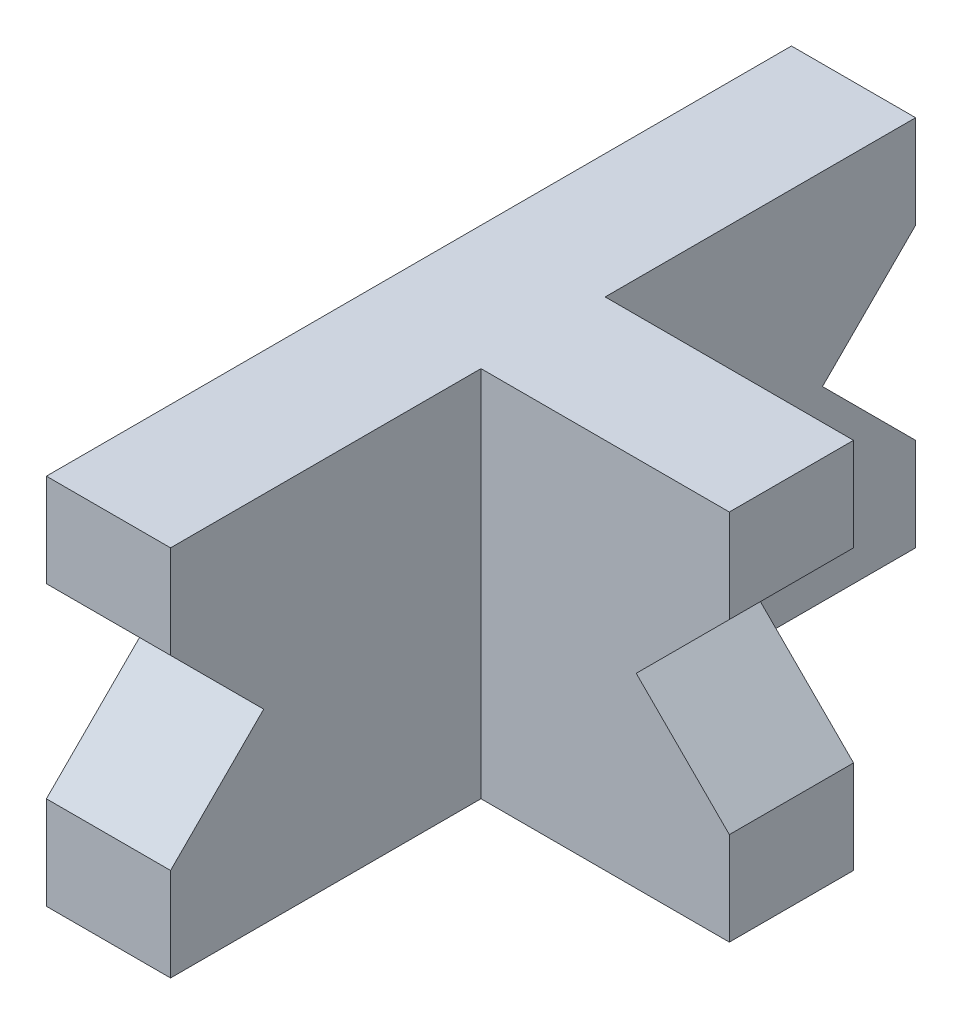
ISO-10303-21;
HEADER;
FILE_DESCRIPTION(('STEP AP214'),'2;1');
FILE_NAME('part.step','',(''),(''),'','','');
FILE_SCHEMA(('AUTOMOTIVE_DESIGN { 1 0 10303 214 1 1 1 1 }'));
ENDSEC;
DATA;
#1=APPLICATION_CONTEXT('core data for automotive mechanical design processes');
#2=APPLICATION_PROTOCOL_DEFINITION('international standard','automotive_design',2000,#1);
#3=PRODUCT_CONTEXT('',#1,'mechanical');
#4=PRODUCT('Part','Part','',(#3));
#5=PRODUCT_RELATED_PRODUCT_CATEGORY('part','',(#4));
#6=PRODUCT_DEFINITION_FORMATION('','',#4);
#7=PRODUCT_DEFINITION_CONTEXT('part definition',#1,'design');
#8=PRODUCT_DEFINITION('design','',#6,#7);
#9=PRODUCT_DEFINITION_SHAPE('','',#8);
#10=(LENGTH_UNIT() NAMED_UNIT(*) SI_UNIT(.MILLI.,.METRE.));
#11=(NAMED_UNIT(*) PLANE_ANGLE_UNIT() SI_UNIT($,.RADIAN.));
#12=(NAMED_UNIT(*) SI_UNIT($,.STERADIAN.) SOLID_ANGLE_UNIT());
#13=UNCERTAINTY_MEASURE_WITH_UNIT(LENGTH_MEASURE(1.E-05),#10,'distance_accuracy_value','');
#14=(GEOMETRIC_REPRESENTATION_CONTEXT(3) GLOBAL_UNCERTAINTY_ASSIGNED_CONTEXT((#13)) GLOBAL_UNIT_ASSIGNED_CONTEXT((#10,
#11,#12)) REPRESENTATION_CONTEXT('',''));
#15=CARTESIAN_POINT('',(0.,0.,0.));
#16=DIRECTION('',(0.,0.,1.));
#17=DIRECTION('',(1.,0.,0.));
#18=AXIS2_PLACEMENT_3D('',#15,#16,#17);
#19=CARTESIAN_POINT('',(20.,0.,0.));
#20=DIRECTION('',(1.,0.,0.));
#21=DIRECTION('',(0.,0.,-1.));
#22=AXIS2_PLACEMENT_3D('',#19,#20,#21);
#23=PLANE('',#22);
#24=DIRECTION('',(0.,0.,1.));
#25=VECTOR('',#24,1.);
#26=CARTESIAN_POINT('',(20.,30.,60.));
#27=LINE('',#26,#25);
#28=CARTESIAN_POINT('',(20.,30.,-60.));
#29=VERTEX_POINT('',#28);
#30=CARTESIAN_POINT('',(20.,30.,-9.99999999999999));
#31=VERTEX_POINT('',#30);
#32=EDGE_CURVE('E298',#29,#31,#27,.T.);
#33=ORIENTED_EDGE('',*,*,#32,.T.);
#34=DIRECTION('',(0.,-1.,0.));
#35=VECTOR('',#34,1.);
#36=CARTESIAN_POINT('',(20.,30.,-10.));
#37=LINE('',#36,#35);
#38=CARTESIAN_POINT('',(20.,-30.,-9.99999999999999));
#39=VERTEX_POINT('',#38);
#40=EDGE_CURVE('E57',#31,#39,#37,.T.);
#41=ORIENTED_EDGE('',*,*,#40,.T.);
#42=DIRECTION('',(0.,0.,-1.));
#43=VECTOR('',#42,1.);
#44=CARTESIAN_POINT('',(20.,-30.,60.));
#45=LINE('',#44,#43);
#46=CARTESIAN_POINT('',(20.,-30.,-60.));
#47=VERTEX_POINT('',#46);
#48=EDGE_CURVE('E170',#39,#47,#45,.T.);
#49=ORIENTED_EDGE('',*,*,#48,.T.);
#50=DIRECTION('',(0.,1.,0.));
#51=VECTOR('',#50,1.);
#52=CARTESIAN_POINT('',(20.,30.,-60.));
#53=LINE('',#52,#51);
#54=CARTESIAN_POINT('',(20.,-15.,-60.));
#55=VERTEX_POINT('',#54);
#56=EDGE_CURVE('E292',#47,#55,#53,.T.);
#57=ORIENTED_EDGE('',*,*,#56,.T.);
#58=DIRECTION('',(0.,0.707106781186546,0.707106781186549));
#59=VECTOR('',#58,1.);
#60=CARTESIAN_POINT('',(20.,22.5,-22.4999999999999));
#61=LINE('',#60,#59);
#62=CARTESIAN_POINT('',(20.,0.,-44.9999999999999));
#63=VERTEX_POINT('',#62);
#64=EDGE_CURVE('E246',#55,#63,#61,.T.);
#65=ORIENTED_EDGE('',*,*,#64,.T.);
#66=DIRECTION('',(0.,0.707106781186546,-0.707106781186549));
#67=VECTOR('',#66,1.);
#68=CARTESIAN_POINT('',(20.,-22.5,-22.4999999999999));
#69=LINE('',#68,#67);
#70=CARTESIAN_POINT('',(20.,15.,-60.));
#71=VERTEX_POINT('',#70);
#72=EDGE_CURVE('E242',#63,#71,#69,.T.);
#73=ORIENTED_EDGE('',*,*,#72,.T.);
#74=EDGE_CURVE('E297',#71,#29,#53,.T.);
#75=ORIENTED_EDGE('',*,*,#74,.T.);
#76=EDGE_LOOP('',(#33,#41,#49,#57,#65,#73,#75));
#77=FACE_BOUND('',#76,.T.);
#78=ADVANCED_FACE('F41',(#77),#23,.T.);
#79=CARTESIAN_POINT('',(20.,30.,-60.));
#80=DIRECTION('',(0.,0.,1.));
#81=DIRECTION('',(0.,-1.,0.));
#82=AXIS2_PLACEMENT_3D('',#79,#80,#81);
#83=PLANE('',#82);
#84=ORIENTED_EDGE('',*,*,#74,.F.);
#85=DIRECTION('',(-1.,0.,0.));
#86=VECTOR('',#85,1.);
#87=CARTESIAN_POINT('',(20.,15.,-60.));
#88=LINE('',#87,#86);
#89=CARTESIAN_POINT('',(0.,15.,-60.));
#90=VERTEX_POINT('',#89);
#91=EDGE_CURVE('E251',#71,#90,#88,.T.);
#92=ORIENTED_EDGE('',*,*,#91,.T.);
#93=DIRECTION('',(0.,1.,0.));
#94=VECTOR('',#93,1.);
#95=CARTESIAN_POINT('',(0.,30.,-60.));
#96=LINE('',#95,#94);
#97=CARTESIAN_POINT('',(0.,30.,-60.));
#98=VERTEX_POINT('',#97);
#99=EDGE_CURVE('E284',#90,#98,#96,.T.);
#100=ORIENTED_EDGE('',*,*,#99,.T.);
#101=DIRECTION('',(-1.,0.,0.));
#102=VECTOR('',#101,1.);
#103=CARTESIAN_POINT('',(20.,30.,-60.));
#104=LINE('',#103,#102);
#105=EDGE_CURVE('E11',#29,#98,#104,.T.);
#106=ORIENTED_EDGE('',*,*,#105,.F.);
#107=EDGE_LOOP('',(#84,#92,#100,#106));
#108=FACE_BOUND('',#107,.T.);
#109=ADVANCED_FACE('F356',(#108),#83,.F.);
#110=CARTESIAN_POINT('',(20.,30.,60.));
#111=DIRECTION('',(0.,0.,-1.));
#112=DIRECTION('',(0.,1.,0.));
#113=AXIS2_PLACEMENT_3D('',#110,#111,#112);
#114=PLANE('',#113);
#115=DIRECTION('',(-1.,0.,0.));
#116=VECTOR('',#115,1.);
#117=CARTESIAN_POINT('',(20.,15.,60.));
#118=LINE('',#117,#116);
#119=CARTESIAN_POINT('',(20.,15.,60.));
#120=VERTEX_POINT('',#119);
#121=CARTESIAN_POINT('',(0.,15.,60.));
#122=VERTEX_POINT('',#121);
#123=EDGE_CURVE('E281',#120,#122,#118,.T.);
#124=ORIENTED_EDGE('',*,*,#123,.F.);
#125=DIRECTION('',(0.,-1.,0.));
#126=VECTOR('',#125,1.);
#127=CARTESIAN_POINT('',(20.,30.,60.));
#128=LINE('',#127,#126);
#129=CARTESIAN_POINT('',(20.,30.,60.));
#130=VERTEX_POINT('',#129);
#131=EDGE_CURVE('E301',#130,#120,#128,.T.);
#132=ORIENTED_EDGE('',*,*,#131,.F.);
#133=DIRECTION('',(-1.,0.,0.));
#134=VECTOR('',#133,1.);
#135=CARTESIAN_POINT('',(20.,30.,60.));
#136=LINE('',#135,#134);
#137=CARTESIAN_POINT('',(0.,30.,60.));
#138=VERTEX_POINT('',#137);
#139=EDGE_CURVE('E50',#130,#138,#136,.T.);
#140=ORIENTED_EDGE('',*,*,#139,.T.);
#141=DIRECTION('',(0.,-1.,0.));
#142=VECTOR('',#141,1.);
#143=CARTESIAN_POINT('',(0.,30.,60.));
#144=LINE('',#143,#142);
#145=EDGE_CURVE('E313',#138,#122,#144,.T.);
#146=ORIENTED_EDGE('',*,*,#145,.T.);
#147=EDGE_LOOP('',(#124,#132,#140,#146));
#148=FACE_BOUND('',#147,.T.);
#149=ADVANCED_FACE('F332',(#148),#114,.F.);
#150=DIRECTION('',(-1.,0.,0.));
#151=VECTOR('',#150,1.);
#152=CARTESIAN_POINT('',(20.,-15.,60.));
#153=LINE('',#152,#151);
#154=CARTESIAN_POINT('',(20.,-15.,60.));
#155=VERTEX_POINT('',#154);
#156=CARTESIAN_POINT('',(0.,-15.,60.));
#157=VERTEX_POINT('',#156);
#158=EDGE_CURVE('E285',#155,#157,#153,.T.);
#159=ORIENTED_EDGE('',*,*,#158,.T.);
#160=CARTESIAN_POINT('',(0.,-30.,60.));
#161=VERTEX_POINT('',#160);
#162=EDGE_CURVE('E312',#157,#161,#144,.T.);
#163=ORIENTED_EDGE('',*,*,#162,.T.);
#164=DIRECTION('',(-1.,0.,0.));
#165=VECTOR('',#164,1.);
#166=CARTESIAN_POINT('',(20.,-30.,60.));
#167=LINE('',#166,#165);
#168=CARTESIAN_POINT('',(20.,-30.,60.));
#169=VERTEX_POINT('',#168);
#170=EDGE_CURVE('E323',#169,#161,#167,.T.);
#171=ORIENTED_EDGE('',*,*,#170,.F.);
#172=EDGE_CURVE('E164',#155,#169,#128,.T.);
#173=ORIENTED_EDGE('',*,*,#172,.F.);
#174=EDGE_LOOP('',(#159,#163,#171,#173));
#175=FACE_BOUND('',#174,.T.);
#176=ADVANCED_FACE('F346',(#175),#114,.F.);
#177=DIRECTION('',(0.,-1.,0.));
#178=VECTOR('',#177,1.);
#179=CARTESIAN_POINT('',(20.,30.,10.));
#180=LINE('',#179,#178);
#181=CARTESIAN_POINT('',(20.,30.,10.));
#182=VERTEX_POINT('',#181);
#183=CARTESIAN_POINT('',(20.,-30.,10.));
#184=VERTEX_POINT('',#183);
#185=EDGE_CURVE('E65',#182,#184,#180,.T.);
#186=ORIENTED_EDGE('',*,*,#185,.F.);
#187=EDGE_CURVE('E296',#182,#130,#27,.T.);
#188=ORIENTED_EDGE('',*,*,#187,.T.);
#189=ORIENTED_EDGE('',*,*,#131,.T.);
#190=DIRECTION('',(0.,0.707106781186546,0.707106781186549));
#191=VECTOR('',#190,1.);
#192=CARTESIAN_POINT('',(20.,-22.5,22.4999999999999));
#193=LINE('',#192,#191);
#194=CARTESIAN_POINT('',(20.,0.,44.9999999999999));
#195=VERTEX_POINT('',#194);
#196=EDGE_CURVE('E267',#195,#120,#193,.T.);
#197=ORIENTED_EDGE('',*,*,#196,.F.);
#198=DIRECTION('',(0.,0.707106781186546,-0.707106781186549));
#199=VECTOR('',#198,1.);
#200=CARTESIAN_POINT('',(20.,22.5,22.4999999999999));
#201=LINE('',#200,#199);
#202=EDGE_CURVE('E270',#155,#195,#201,.T.);
#203=ORIENTED_EDGE('',*,*,#202,.F.);
#204=ORIENTED_EDGE('',*,*,#172,.T.);
#205=EDGE_CURVE('E159',#169,#184,#45,.T.);
#206=ORIENTED_EDGE('',*,*,#205,.T.);
#207=EDGE_LOOP('',(#186,#188,#189,#197,#203,#204,#206));
#208=FACE_BOUND('',#207,.T.);
#209=ADVANCED_FACE('F161',(#208),#23,.T.);
#210=CARTESIAN_POINT('',(0.,0.,0.));
#211=DIRECTION('',(1.,0.,0.));
#212=DIRECTION('',(0.,0.,-1.));
#213=AXIS2_PLACEMENT_3D('',#210,#211,#212);
#214=PLANE('',#213);
#215=ORIENTED_EDGE('',*,*,#99,.F.);
#216=DIRECTION('',(0.,0.707106781186546,-0.707106781186549));
#217=VECTOR('',#216,1.);
#218=CARTESIAN_POINT('',(0.,-22.5,-22.4999999999999));
#219=LINE('',#218,#217);
#220=CARTESIAN_POINT('',(0.,0.,-44.9999999999999));
#221=VERTEX_POINT('',#220);
#222=EDGE_CURVE('E241',#221,#90,#219,.T.);
#223=ORIENTED_EDGE('',*,*,#222,.F.);
#224=DIRECTION('',(0.,0.707106781186546,0.707106781186549));
#225=VECTOR('',#224,1.);
#226=CARTESIAN_POINT('',(0.,22.5,-22.4999999999999));
#227=LINE('',#226,#225);
#228=CARTESIAN_POINT('',(0.,-15.,-60.));
#229=VERTEX_POINT('',#228);
#230=EDGE_CURVE('E247',#229,#221,#227,.T.);
#231=ORIENTED_EDGE('',*,*,#230,.F.);
#232=CARTESIAN_POINT('',(0.,-30.,-60.));
#233=VERTEX_POINT('',#232);
#234=EDGE_CURVE('E305',#233,#229,#96,.T.);
#235=ORIENTED_EDGE('',*,*,#234,.F.);
#236=DIRECTION('',(0.,0.,-1.));
#237=VECTOR('',#236,1.);
#238=CARTESIAN_POINT('',(0.,-30.,60.));
#239=LINE('',#238,#237);
#240=EDGE_CURVE('E317',#161,#233,#239,.T.);
#241=ORIENTED_EDGE('',*,*,#240,.F.);
#242=ORIENTED_EDGE('',*,*,#162,.F.);
#243=DIRECTION('',(0.,0.707106781186546,-0.707106781186549));
#244=VECTOR('',#243,1.);
#245=CARTESIAN_POINT('',(0.,22.5,22.4999999999999));
#246=LINE('',#245,#244);
#247=CARTESIAN_POINT('',(0.,0.,44.9999999999999));
#248=VERTEX_POINT('',#247);
#249=EDGE_CURVE('E271',#157,#248,#246,.T.);
#250=ORIENTED_EDGE('',*,*,#249,.T.);
#251=DIRECTION('',(0.,0.707106781186546,0.707106781186549));
#252=VECTOR('',#251,1.);
#253=CARTESIAN_POINT('',(0.,-22.5,22.4999999999999));
#254=LINE('',#253,#252);
#255=EDGE_CURVE('E260',#248,#122,#254,.T.);
#256=ORIENTED_EDGE('',*,*,#255,.T.);
#257=ORIENTED_EDGE('',*,*,#145,.F.);
#258=DIRECTION('',(0.,0.,1.));
#259=VECTOR('',#258,1.);
#260=CARTESIAN_POINT('',(0.,30.,60.));
#261=LINE('',#260,#259);
#262=EDGE_CURVE('E309',#98,#138,#261,.T.);
#263=ORIENTED_EDGE('',*,*,#262,.F.);
#264=EDGE_LOOP('',(#215,#223,#231,#235,#241,#242,#250,#256,#257,#263));
#265=FACE_BOUND('',#264,.T.);
#266=ADVANCED_FACE('F337',(#265),#214,.F.);
#267=ORIENTED_EDGE('',*,*,#234,.T.);
#268=DIRECTION('',(-1.,0.,0.));
#269=VECTOR('',#268,1.);
#270=CARTESIAN_POINT('',(20.,-15.,-60.));
#271=LINE('',#270,#269);
#272=EDGE_CURVE('E261',#55,#229,#271,.T.);
#273=ORIENTED_EDGE('',*,*,#272,.F.);
#274=ORIENTED_EDGE('',*,*,#56,.F.);
#275=DIRECTION('',(-1.,0.,0.));
#276=VECTOR('',#275,1.);
#277=CARTESIAN_POINT('',(20.,-30.,-60.));
#278=LINE('',#277,#276);
#279=EDGE_CURVE('E169',#47,#233,#278,.T.);
#280=ORIENTED_EDGE('',*,*,#279,.T.);
#281=EDGE_LOOP('',(#267,#273,#274,#280));
#282=FACE_BOUND('',#281,.T.);
#283=ADVANCED_FACE('F43',(#282),#83,.F.);
#284=CARTESIAN_POINT('',(20.,30.,60.));
#285=DIRECTION('',(0.,-1.,0.));
#286=DIRECTION('',(0.,0.,-1.));
#287=AXIS2_PLACEMENT_3D('',#284,#285,#286);
#288=PLANE('',#287);
#289=ORIENTED_EDGE('',*,*,#262,.T.);
#290=ORIENTED_EDGE('',*,*,#139,.F.);
#291=ORIENTED_EDGE('',*,*,#187,.F.);
#292=DIRECTION('',(-1.,0.,0.));
#293=VECTOR('',#292,1.);
#294=CARTESIAN_POINT('',(20.,30.,10.));
#295=LINE('',#294,#293);
#296=CARTESIAN_POINT('',(60.,30.,10.));
#297=VERTEX_POINT('',#296);
#298=EDGE_CURVE('E185',#297,#182,#295,.T.);
#299=ORIENTED_EDGE('',*,*,#298,.F.);
#300=DIRECTION('',(0.,0.,-1.));
#301=VECTOR('',#300,1.);
#302=CARTESIAN_POINT('',(60.,30.,10.));
#303=LINE('',#302,#301);
#304=CARTESIAN_POINT('',(60.,30.,-10.));
#305=VERTEX_POINT('',#304);
#306=EDGE_CURVE('E207',#297,#305,#303,.T.);
#307=ORIENTED_EDGE('',*,*,#306,.T.);
#308=DIRECTION('',(-1.,0.,0.));
#309=VECTOR('',#308,1.);
#310=CARTESIAN_POINT('',(20.,30.,-10.));
#311=LINE('',#310,#309);
#312=EDGE_CURVE('E187',#305,#31,#311,.T.);
#313=ORIENTED_EDGE('',*,*,#312,.T.);
#314=ORIENTED_EDGE('',*,*,#32,.F.);
#315=ORIENTED_EDGE('',*,*,#105,.T.);
#316=EDGE_LOOP('',(#289,#290,#291,#299,#307,#313,#314,#315));
#317=FACE_BOUND('',#316,.T.);
#318=ADVANCED_FACE('F393',(#317),#288,.F.);
#319=CARTESIAN_POINT('',(20.,-30.,60.));
#320=DIRECTION('',(0.,1.,0.));
#321=DIRECTION('',(0.,0.,1.));
#322=AXIS2_PLACEMENT_3D('',#319,#320,#321);
#323=PLANE('',#322);
#324=ORIENTED_EDGE('',*,*,#240,.T.);
#325=ORIENTED_EDGE('',*,*,#279,.F.);
#326=ORIENTED_EDGE('',*,*,#48,.F.);
#327=DIRECTION('',(1.,0.,0.));
#328=VECTOR('',#327,1.);
#329=CARTESIAN_POINT('',(60.,-30.,-10.));
#330=LINE('',#329,#328);
#331=CARTESIAN_POINT('',(60.,-30.,-10.));
#332=VERTEX_POINT('',#331);
#333=EDGE_CURVE('E210',#39,#332,#330,.T.);
#334=ORIENTED_EDGE('',*,*,#333,.T.);
#335=DIRECTION('',(0.,0.,-1.));
#336=VECTOR('',#335,1.);
#337=CARTESIAN_POINT('',(60.,-30.,10.));
#338=LINE('',#337,#336);
#339=CARTESIAN_POINT('',(60.,-30.,10.));
#340=VERTEX_POINT('',#339);
#341=EDGE_CURVE('E176',#340,#332,#338,.T.);
#342=ORIENTED_EDGE('',*,*,#341,.F.);
#343=DIRECTION('',(1.,0.,0.));
#344=VECTOR('',#343,1.);
#345=CARTESIAN_POINT('',(60.,-30.,10.));
#346=LINE('',#345,#344);
#347=EDGE_CURVE('E173',#184,#340,#346,.T.);
#348=ORIENTED_EDGE('',*,*,#347,.F.);
#349=ORIENTED_EDGE('',*,*,#205,.F.);
#350=ORIENTED_EDGE('',*,*,#170,.T.);
#351=EDGE_LOOP('',(#324,#325,#326,#334,#342,#348,#349,#350));
#352=FACE_BOUND('',#351,.T.);
#353=ADVANCED_FACE('F174',(#352),#323,.F.);
#354=CARTESIAN_POINT('',(20.,-22.5,22.4999999999999));
#355=DIRECTION('',(0.,-0.707106781186549,0.707106781186546));
#356=DIRECTION('',(0.,-0.707106781186546,-0.707106781186549));
#357=AXIS2_PLACEMENT_3D('',#354,#355,#356);
#358=PLANE('',#357);
#359=ORIENTED_EDGE('',*,*,#255,.F.);
#360=DIRECTION('',(-1.,0.,0.));
#361=VECTOR('',#360,1.);
#362=CARTESIAN_POINT('',(20.,0.,44.9999999999999));
#363=LINE('',#362,#361);
#364=EDGE_CURVE('E274',#195,#248,#363,.T.);
#365=ORIENTED_EDGE('',*,*,#364,.F.);
#366=ORIENTED_EDGE('',*,*,#196,.T.);
#367=ORIENTED_EDGE('',*,*,#123,.T.);
#368=EDGE_LOOP('',(#359,#365,#366,#367));
#369=FACE_BOUND('',#368,.T.);
#370=ADVANCED_FACE('F341',(#369),#358,.T.);
#371=CARTESIAN_POINT('',(20.,22.5,22.4999999999999));
#372=DIRECTION('',(0.,0.707106781186549,0.707106781186546));
#373=DIRECTION('',(0.,-0.707106781186546,0.707106781186549));
#374=AXIS2_PLACEMENT_3D('',#371,#372,#373);
#375=PLANE('',#374);
#376=ORIENTED_EDGE('',*,*,#249,.F.);
#377=ORIENTED_EDGE('',*,*,#158,.F.);
#378=ORIENTED_EDGE('',*,*,#202,.T.);
#379=ORIENTED_EDGE('',*,*,#364,.T.);
#380=EDGE_LOOP('',(#376,#377,#378,#379));
#381=FACE_BOUND('',#380,.T.);
#382=ADVANCED_FACE('F344',(#381),#375,.T.);
#383=CARTESIAN_POINT('',(20.,-22.5,-22.4999999999999));
#384=DIRECTION('',(0.,0.707106781186549,0.707106781186546));
#385=DIRECTION('',(0.,-0.707106781186546,0.707106781186549));
#386=AXIS2_PLACEMENT_3D('',#383,#384,#385);
#387=PLANE('',#386);
#388=ORIENTED_EDGE('',*,*,#222,.T.);
#389=ORIENTED_EDGE('',*,*,#91,.F.);
#390=ORIENTED_EDGE('',*,*,#72,.F.);
#391=DIRECTION('',(-1.,0.,0.));
#392=VECTOR('',#391,1.);
#393=CARTESIAN_POINT('',(20.,0.,-44.9999999999999));
#394=LINE('',#393,#392);
#395=EDGE_CURVE('E257',#63,#221,#394,.T.);
#396=ORIENTED_EDGE('',*,*,#395,.T.);
#397=EDGE_LOOP('',(#388,#389,#390,#396));
#398=FACE_BOUND('',#397,.T.);
#399=ADVANCED_FACE('F361',(#398),#387,.F.);
#400=CARTESIAN_POINT('',(20.,22.5,-22.4999999999999));
#401=DIRECTION('',(0.,-0.707106781186549,0.707106781186546));
#402=DIRECTION('',(0.,-0.707106781186546,-0.707106781186549));
#403=AXIS2_PLACEMENT_3D('',#400,#401,#402);
#404=PLANE('',#403);
#405=ORIENTED_EDGE('',*,*,#230,.T.);
#406=ORIENTED_EDGE('',*,*,#395,.F.);
#407=ORIENTED_EDGE('',*,*,#64,.F.);
#408=ORIENTED_EDGE('',*,*,#272,.T.);
#409=EDGE_LOOP('',(#405,#406,#407,#408));
#410=FACE_BOUND('',#409,.T.);
#411=ADVANCED_FACE('F364',(#410),#404,.F.);
#412=CARTESIAN_POINT('',(60.,-30.,10.));
#413=DIRECTION('',(-1.,0.,0.));
#414=DIRECTION('',(0.,-1.,0.));
#415=AXIS2_PLACEMENT_3D('',#412,#413,#414);
#416=PLANE('',#415);
#417=DIRECTION('',(0.,1.,0.));
#418=VECTOR('',#417,1.);
#419=CARTESIAN_POINT('',(60.,-30.,-10.));
#420=LINE('',#419,#418);
#421=CARTESIAN_POINT('',(60.,-15.,-10.));
#422=VERTEX_POINT('',#421);
#423=EDGE_CURVE('E213',#332,#422,#420,.T.);
#424=ORIENTED_EDGE('',*,*,#423,.T.);
#425=DIRECTION('',(0.,0.,-1.));
#426=VECTOR('',#425,1.);
#427=CARTESIAN_POINT('',(60.,-15.,10.));
#428=LINE('',#427,#426);
#429=CARTESIAN_POINT('',(60.,-15.,10.));
#430=VERTEX_POINT('',#429);
#431=EDGE_CURVE('E235',#430,#422,#428,.T.);
#432=ORIENTED_EDGE('',*,*,#431,.F.);
#433=DIRECTION('',(0.,1.,0.));
#434=VECTOR('',#433,1.);
#435=CARTESIAN_POINT('',(60.,-30.,10.));
#436=LINE('',#435,#434);
#437=EDGE_CURVE('E180',#340,#430,#436,.T.);
#438=ORIENTED_EDGE('',*,*,#437,.F.);
#439=ORIENTED_EDGE('',*,*,#341,.T.);
#440=EDGE_LOOP('',(#424,#432,#438,#439));
#441=FACE_BOUND('',#440,.T.);
#442=ADVANCED_FACE('F379',(#441),#416,.F.);
#443=CARTESIAN_POINT('',(45.,0.,10.));
#444=DIRECTION('',(-0.707106781186547,-0.707106781186549,0.));
#445=DIRECTION('',(0.707106781186549,-0.707106781186547,0.));
#446=AXIS2_PLACEMENT_3D('',#443,#444,#445);
#447=PLANE('',#446);
#448=DIRECTION('',(-0.707106781186549,0.707106781186547,0.));
#449=VECTOR('',#448,1.);
#450=CARTESIAN_POINT('',(45.,0.,-10.));
#451=LINE('',#450,#449);
#452=CARTESIAN_POINT('',(45.,0.,-10.));
#453=VERTEX_POINT('',#452);
#454=EDGE_CURVE('E216',#422,#453,#451,.T.);
#455=ORIENTED_EDGE('',*,*,#454,.T.);
#456=DIRECTION('',(0.,0.,-1.));
#457=VECTOR('',#456,1.);
#458=CARTESIAN_POINT('',(45.,0.,10.));
#459=LINE('',#458,#457);
#460=CARTESIAN_POINT('',(45.,0.,10.));
#461=VERTEX_POINT('',#460);
#462=EDGE_CURVE('E231',#461,#453,#459,.T.);
#463=ORIENTED_EDGE('',*,*,#462,.F.);
#464=DIRECTION('',(-0.707106781186549,0.707106781186547,0.));
#465=VECTOR('',#464,1.);
#466=CARTESIAN_POINT('',(45.,0.,10.));
#467=LINE('',#466,#465);
#468=EDGE_CURVE('E196',#430,#461,#467,.T.);
#469=ORIENTED_EDGE('',*,*,#468,.F.);
#470=ORIENTED_EDGE('',*,*,#431,.T.);
#471=EDGE_LOOP('',(#455,#463,#469,#470));
#472=FACE_BOUND('',#471,.T.);
#473=ADVANCED_FACE('F382',(#472),#447,.F.);
#474=CARTESIAN_POINT('',(60.,15.,10.));
#475=DIRECTION('',(-0.707106781186547,0.707106781186549,0.));
#476=DIRECTION('',(-0.707106781186549,-0.707106781186547,0.));
#477=AXIS2_PLACEMENT_3D('',#474,#475,#476);
#478=PLANE('',#477);
#479=DIRECTION('',(0.707106781186549,0.707106781186547,0.));
#480=VECTOR('',#479,1.);
#481=CARTESIAN_POINT('',(60.,15.,-10.));
#482=LINE('',#481,#480);
#483=CARTESIAN_POINT('',(60.,15.,-10.));
#484=VERTEX_POINT('',#483);
#485=EDGE_CURVE('E219',#453,#484,#482,.T.);
#486=ORIENTED_EDGE('',*,*,#485,.T.);
#487=DIRECTION('',(0.,0.,-1.));
#488=VECTOR('',#487,1.);
#489=CARTESIAN_POINT('',(60.,15.,10.));
#490=LINE('',#489,#488);
#491=CARTESIAN_POINT('',(60.,15.,10.));
#492=VERTEX_POINT('',#491);
#493=EDGE_CURVE('E227',#492,#484,#490,.T.);
#494=ORIENTED_EDGE('',*,*,#493,.F.);
#495=DIRECTION('',(0.707106781186549,0.707106781186547,0.));
#496=VECTOR('',#495,1.);
#497=CARTESIAN_POINT('',(60.,15.,10.));
#498=LINE('',#497,#496);
#499=EDGE_CURVE('E199',#461,#492,#498,.T.);
#500=ORIENTED_EDGE('',*,*,#499,.F.);
#501=ORIENTED_EDGE('',*,*,#462,.T.);
#502=EDGE_LOOP('',(#486,#494,#500,#501));
#503=FACE_BOUND('',#502,.T.);
#504=ADVANCED_FACE('F389',(#503),#478,.F.);
#505=CARTESIAN_POINT('',(60.,30.,10.));
#506=DIRECTION('',(-1.,0.,0.));
#507=DIRECTION('',(0.,-1.,0.));
#508=AXIS2_PLACEMENT_3D('',#505,#506,#507);
#509=PLANE('',#508);
#510=DIRECTION('',(0.,1.,0.));
#511=VECTOR('',#510,1.);
#512=CARTESIAN_POINT('',(60.,30.,-10.));
#513=LINE('',#512,#511);
#514=EDGE_CURVE('E191',#484,#305,#513,.T.);
#515=ORIENTED_EDGE('',*,*,#514,.T.);
#516=ORIENTED_EDGE('',*,*,#306,.F.);
#517=DIRECTION('',(0.,1.,0.));
#518=VECTOR('',#517,1.);
#519=CARTESIAN_POINT('',(60.,30.,10.));
#520=LINE('',#519,#518);
#521=EDGE_CURVE('E202',#492,#297,#520,.T.);
#522=ORIENTED_EDGE('',*,*,#521,.F.);
#523=ORIENTED_EDGE('',*,*,#493,.T.);
#524=EDGE_LOOP('',(#515,#516,#522,#523));
#525=FACE_BOUND('',#524,.T.);
#526=ADVANCED_FACE('F392',(#525),#509,.F.);
#527=CARTESIAN_POINT('',(0.,0.,10.));
#528=DIRECTION('',(0.,0.,-1.));
#529=DIRECTION('',(-1.,0.,0.));
#530=AXIS2_PLACEMENT_3D('',#527,#528,#529);
#531=PLANE('',#530);
#532=ORIENTED_EDGE('',*,*,#185,.T.);
#533=ORIENTED_EDGE('',*,*,#347,.T.);
#534=ORIENTED_EDGE('',*,*,#437,.T.);
#535=ORIENTED_EDGE('',*,*,#468,.T.);
#536=ORIENTED_EDGE('',*,*,#499,.T.);
#537=ORIENTED_EDGE('',*,*,#521,.T.);
#538=ORIENTED_EDGE('',*,*,#298,.T.);
#539=EDGE_LOOP('',(#532,#533,#534,#535,#536,#537,#538));
#540=FACE_BOUND('',#539,.T.);
#541=ADVANCED_FACE('F183',(#540),#531,.F.);
#542=CARTESIAN_POINT('',(0.,0.,-10.));
#543=DIRECTION('',(0.,0.,-1.));
#544=DIRECTION('',(-1.,0.,0.));
#545=AXIS2_PLACEMENT_3D('',#542,#543,#544);
#546=PLANE('',#545);
#547=ORIENTED_EDGE('',*,*,#40,.F.);
#548=ORIENTED_EDGE('',*,*,#312,.F.);
#549=ORIENTED_EDGE('',*,*,#514,.F.);
#550=ORIENTED_EDGE('',*,*,#485,.F.);
#551=ORIENTED_EDGE('',*,*,#454,.F.);
#552=ORIENTED_EDGE('',*,*,#423,.F.);
#553=ORIENTED_EDGE('',*,*,#333,.F.);
#554=EDGE_LOOP('',(#547,#548,#549,#550,#551,#552,#553));
#555=FACE_BOUND('',#554,.T.);
#556=ADVANCED_FACE('F373',(#555),#546,.T.);
#557=CLOSED_SHELL('',(#78,#109,#149,#176,#209,#266,#283,#318,#353,#370,#382,#399,#411,#442,#473,
#504,#526,#541,#556));
#558=MANIFOLD_SOLID_BREP('B2',#557);
#559=ADVANCED_BREP_SHAPE_REPRESENTATION('',(#18,#558),#14);
#560=SHAPE_DEFINITION_REPRESENTATION(#9,#559);
ENDSEC;
END-ISO-10303-21;
